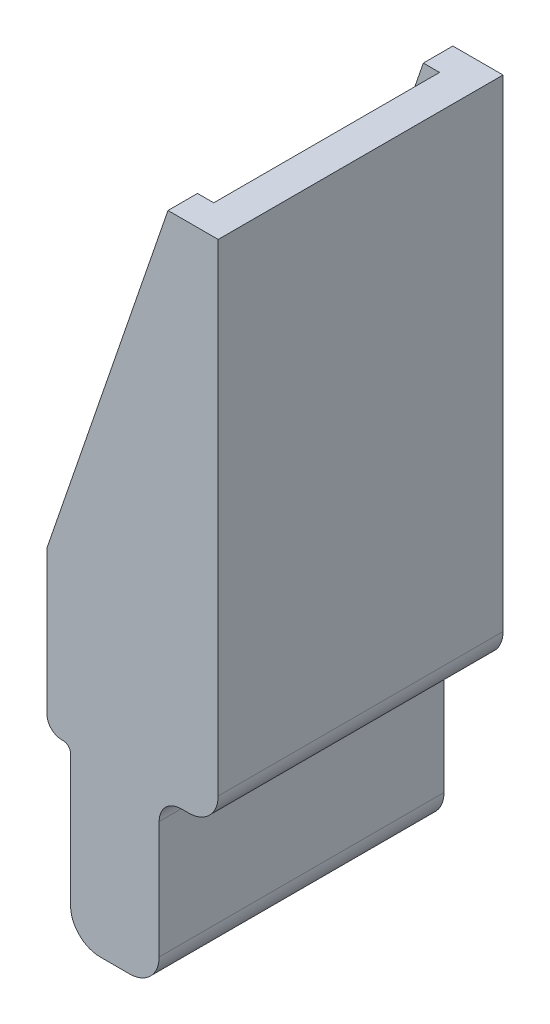
ISO-10303-21;
HEADER;
FILE_DESCRIPTION(('STEP AP214'),'2;1');
FILE_NAME('part.step','',(''),(''),'','','');
FILE_SCHEMA(('AUTOMOTIVE_DESIGN { 1 0 10303 214 1 1 1 1 }'));
ENDSEC;
DATA;
#1=APPLICATION_CONTEXT('core data for automotive mechanical design processes');
#2=APPLICATION_PROTOCOL_DEFINITION('international standard','automotive_design',2000,#1);
#3=PRODUCT_CONTEXT('',#1,'mechanical');
#4=PRODUCT('Part','Part','',(#3));
#5=PRODUCT_RELATED_PRODUCT_CATEGORY('part','',(#4));
#6=PRODUCT_DEFINITION_FORMATION('','',#4);
#7=PRODUCT_DEFINITION_CONTEXT('part definition',#1,'design');
#8=PRODUCT_DEFINITION('design','',#6,#7);
#9=PRODUCT_DEFINITION_SHAPE('','',#8);
#10=(LENGTH_UNIT() NAMED_UNIT(*) SI_UNIT(.MILLI.,.METRE.));
#11=(NAMED_UNIT(*) PLANE_ANGLE_UNIT() SI_UNIT($,.RADIAN.));
#12=(NAMED_UNIT(*) SI_UNIT($,.STERADIAN.) SOLID_ANGLE_UNIT());
#13=UNCERTAINTY_MEASURE_WITH_UNIT(LENGTH_MEASURE(1.E-05),#10,'distance_accuracy_value','');
#14=(GEOMETRIC_REPRESENTATION_CONTEXT(3) GLOBAL_UNCERTAINTY_ASSIGNED_CONTEXT((#13)) GLOBAL_UNIT_ASSIGNED_CONTEXT((#10,
#11,#12)) REPRESENTATION_CONTEXT('',''));
#15=CARTESIAN_POINT('',(0.,0.,0.));
#16=DIRECTION('',(0.,0.,1.));
#17=DIRECTION('',(1.,0.,0.));
#18=AXIS2_PLACEMENT_3D('',#15,#16,#17);
#19=CARTESIAN_POINT('',(2.4,23.05,19.3));
#20=DIRECTION('',(0.945876542694601,-0.324526679920324,0.));
#21=DIRECTION('',(0.324526679920324,0.945876542694601,0.));
#22=AXIS2_PLACEMENT_3D('',#19,#20,#21);
#23=PLANE('',#22);
#24=DIRECTION('',(0.,0.,-1.));
#25=VECTOR('',#24,1.);
#26=CARTESIAN_POINT('',(-5.80000000000001,-0.850000000000011,19.3));
#27=LINE('',#26,#25);
#28=CARTESIAN_POINT('',(-5.8,-0.850000000000011,2.));
#29=VERTEX_POINT('',#28);
#30=CARTESIAN_POINT('',(-5.80000000000001,-0.850000000000011,0.));
#31=VERTEX_POINT('',#30);
#32=EDGE_CURVE('E240',#29,#31,#27,.T.);
#33=ORIENTED_EDGE('',*,*,#32,.F.);
#34=DIRECTION('',(0.324526679920324,0.945876542694601,0.));
#35=VECTOR('',#34,1.);
#36=CARTESIAN_POINT('',(2.4,23.05,2.));
#37=LINE('',#36,#35);
#38=CARTESIAN_POINT('',(2.4,23.05,2.));
#39=VERTEX_POINT('',#38);
#40=EDGE_CURVE('E187',#29,#39,#37,.T.);
#41=ORIENTED_EDGE('',*,*,#40,.T.);
#42=DIRECTION('',(0.,0.,-1.));
#43=VECTOR('',#42,1.);
#44=CARTESIAN_POINT('',(2.4,23.05,19.3));
#45=LINE('',#44,#43);
#46=CARTESIAN_POINT('',(2.4,23.05,0.));
#47=VERTEX_POINT('',#46);
#48=EDGE_CURVE('E244',#39,#47,#45,.T.);
#49=ORIENTED_EDGE('',*,*,#48,.T.);
#50=DIRECTION('',(-0.324526679920324,-0.945876542694601,0.));
#51=VECTOR('',#50,1.);
#52=CARTESIAN_POINT('',(2.4,23.05,0.));
#53=LINE('',#52,#51);
#54=EDGE_CURVE('E192',#47,#31,#53,.T.);
#55=ORIENTED_EDGE('',*,*,#54,.T.);
#56=EDGE_LOOP('',(#33,#41,#49,#55));
#57=FACE_BOUND('',#56,.T.);
#58=ADVANCED_FACE('F32',(#57),#23,.F.);
#59=CARTESIAN_POINT('',(3.79999999999999,-9.60695568829757,19.3));
#60=DIRECTION('',(0.,0.,-1.));
#61=DIRECTION('',(-1.,0.,0.));
#62=AXIS2_PLACEMENT_3D('',#59,#60,#61);
#63=CYLINDRICAL_SURFACE('',#62,2.);
#64=CARTESIAN_POINT('',(3.79999999999999,-9.60695568829757,0.));
#65=DIRECTION('',(0.,0.,1.));
#66=DIRECTION('',(1.,0.,0.));
#67=AXIS2_PLACEMENT_3D('',#64,#65,#66);
#68=CIRCLE('',#67,2.);
#69=CARTESIAN_POINT('',(3.79999999999998,-11.6069556882976,0.));
#70=VERTEX_POINT('',#69);
#71=CARTESIAN_POINT('',(5.79999999999999,-9.60695568829756,0.));
#72=VERTEX_POINT('',#71);
#73=EDGE_CURVE('E183',#70,#72,#68,.T.);
#74=ORIENTED_EDGE('',*,*,#73,.T.);
#75=DIRECTION('',(0.,0.,-1.));
#76=VECTOR('',#75,1.);
#77=CARTESIAN_POINT('',(5.79999999999999,-9.60695568829756,19.3));
#78=LINE('',#77,#76);
#79=CARTESIAN_POINT('',(5.79999999999999,-9.60695568829756,19.3));
#80=VERTEX_POINT('',#79);
#81=EDGE_CURVE('E40',#80,#72,#78,.T.);
#82=ORIENTED_EDGE('',*,*,#81,.F.);
#83=CARTESIAN_POINT('',(3.79999999999999,-9.60695568829757,19.3));
#84=DIRECTION('',(0.,0.,1.));
#85=DIRECTION('',(1.,0.,0.));
#86=AXIS2_PLACEMENT_3D('',#83,#84,#85);
#87=CIRCLE('',#86,2.);
#88=CARTESIAN_POINT('',(3.79999999999998,-11.6069556882976,19.3));
#89=VERTEX_POINT('',#88);
#90=EDGE_CURVE('E215',#89,#80,#87,.T.);
#91=ORIENTED_EDGE('',*,*,#90,.F.);
#92=DIRECTION('',(0.,0.,-1.));
#93=VECTOR('',#92,1.);
#94=CARTESIAN_POINT('',(3.79999999999998,-11.6069556882976,19.3));
#95=LINE('',#94,#93);
#96=EDGE_CURVE('E179',#89,#70,#95,.T.);
#97=ORIENTED_EDGE('',*,*,#96,.T.);
#98=EDGE_LOOP('',(#74,#82,#91,#97));
#99=FACE_BOUND('',#98,.T.);
#100=ADVANCED_FACE('F34',(#99),#63,.T.);
#101=CARTESIAN_POINT('',(5.79999999999999,-9.60695568829756,19.3));
#102=DIRECTION('',(-1.,0.,0.));
#103=DIRECTION('',(0.,0.,1.));
#104=AXIS2_PLACEMENT_3D('',#101,#102,#103);
#105=PLANE('',#104);
#106=DIRECTION('',(0.,1.,0.));
#107=VECTOR('',#106,1.);
#108=CARTESIAN_POINT('',(5.79999999999999,-9.60695568829756,0.));
#109=LINE('',#108,#107);
#110=CARTESIAN_POINT('',(5.79999999999999,23.05,0.));
#111=VERTEX_POINT('',#110);
#112=EDGE_CURVE('E186',#72,#111,#109,.T.);
#113=ORIENTED_EDGE('',*,*,#112,.T.);
#114=DIRECTION('',(0.,0.,-1.));
#115=VECTOR('',#114,1.);
#116=CARTESIAN_POINT('',(5.79999999999999,23.05,19.3));
#117=LINE('',#116,#115);
#118=CARTESIAN_POINT('',(5.79999999999999,23.05,19.3));
#119=VERTEX_POINT('',#118);
#120=EDGE_CURVE('E248',#119,#111,#117,.T.);
#121=ORIENTED_EDGE('',*,*,#120,.F.);
#122=DIRECTION('',(0.,1.,0.));
#123=VECTOR('',#122,1.);
#124=CARTESIAN_POINT('',(5.79999999999999,-9.60695568829756,19.3));
#125=LINE('',#124,#123);
#126=EDGE_CURVE('E119',#80,#119,#125,.T.);
#127=ORIENTED_EDGE('',*,*,#126,.F.);
#128=ORIENTED_EDGE('',*,*,#81,.T.);
#129=EDGE_LOOP('',(#113,#121,#127,#128));
#130=FACE_BOUND('',#129,.T.);
#131=ADVANCED_FACE('F251',(#130),#105,.F.);
#132=CARTESIAN_POINT('',(5.79999999999999,23.05,19.3));
#133=DIRECTION('',(0.,-1.,0.));
#134=DIRECTION('',(1.,0.,0.));
#135=AXIS2_PLACEMENT_3D('',#132,#133,#134);
#136=PLANE('',#135);
#137=ORIENTED_EDGE('',*,*,#48,.F.);
#138=DIRECTION('',(-1.,0.,0.));
#139=VECTOR('',#138,1.);
#140=CARTESIAN_POINT('',(3.5,23.05,2.));
#141=LINE('',#140,#139);
#142=CARTESIAN_POINT('',(3.5,23.05,2.));
#143=VERTEX_POINT('',#142);
#144=EDGE_CURVE('E311',#143,#39,#141,.T.);
#145=ORIENTED_EDGE('',*,*,#144,.F.);
#146=DIRECTION('',(0.,0.,-1.));
#147=VECTOR('',#146,1.);
#148=CARTESIAN_POINT('',(3.5,23.05,17.3));
#149=LINE('',#148,#147);
#150=CARTESIAN_POINT('',(3.5,23.05,17.3));
#151=VERTEX_POINT('',#150);
#152=EDGE_CURVE('E322',#151,#143,#149,.T.);
#153=ORIENTED_EDGE('',*,*,#152,.F.);
#154=DIRECTION('',(-1.,0.,0.));
#155=VECTOR('',#154,1.);
#156=CARTESIAN_POINT('',(3.5,23.05,17.3));
#157=LINE('',#156,#155);
#158=CARTESIAN_POINT('',(2.4,23.05,17.3));
#159=VERTEX_POINT('',#158);
#160=EDGE_CURVE('E308',#151,#159,#157,.T.);
#161=ORIENTED_EDGE('',*,*,#160,.T.);
#162=CARTESIAN_POINT('',(2.4,23.05,19.3));
#163=VERTEX_POINT('',#162);
#164=EDGE_CURVE('E245',#163,#159,#45,.T.);
#165=ORIENTED_EDGE('',*,*,#164,.F.);
#166=DIRECTION('',(-1.,0.,0.));
#167=VECTOR('',#166,1.);
#168=CARTESIAN_POINT('',(5.79999999999999,23.05,19.3));
#169=LINE('',#168,#167);
#170=EDGE_CURVE('E266',#119,#163,#169,.T.);
#171=ORIENTED_EDGE('',*,*,#170,.F.);
#172=ORIENTED_EDGE('',*,*,#120,.T.);
#173=DIRECTION('',(-1.,0.,0.));
#174=VECTOR('',#173,1.);
#175=CARTESIAN_POINT('',(5.79999999999999,23.05,0.));
#176=LINE('',#175,#174);
#177=EDGE_CURVE('E189',#111,#47,#176,.T.);
#178=ORIENTED_EDGE('',*,*,#177,.T.);
#179=EDGE_LOOP('',(#137,#145,#153,#161,#165,#171,#172,#178));
#180=FACE_BOUND('',#179,.T.);
#181=ADVANCED_FACE('F262',(#180),#136,.F.);
#182=ORIENTED_EDGE('',*,*,#164,.T.);
#183=DIRECTION('',(-0.324526679920324,-0.945876542694601,0.));
#184=VECTOR('',#183,1.);
#185=CARTESIAN_POINT('',(2.4,23.05,17.3));
#186=LINE('',#185,#184);
#187=CARTESIAN_POINT('',(-5.8,-0.850000000000011,17.3));
#188=VERTEX_POINT('',#187);
#189=EDGE_CURVE('E302',#159,#188,#186,.T.);
#190=ORIENTED_EDGE('',*,*,#189,.T.);
#191=CARTESIAN_POINT('',(-5.80000000000001,-0.850000000000011,19.3));
#192=VERTEX_POINT('',#191);
#193=EDGE_CURVE('E241',#192,#188,#27,.T.);
#194=ORIENTED_EDGE('',*,*,#193,.F.);
#195=DIRECTION('',(-0.324526679920324,-0.945876542694601,0.));
#196=VECTOR('',#195,1.);
#197=CARTESIAN_POINT('',(2.4,23.05,19.3));
#198=LINE('',#197,#196);
#199=EDGE_CURVE('E269',#163,#192,#198,.T.);
#200=ORIENTED_EDGE('',*,*,#199,.F.);
#201=EDGE_LOOP('',(#182,#190,#194,#200));
#202=FACE_BOUND('',#201,.T.);
#203=ADVANCED_FACE('F369',(#202),#23,.F.);
#204=CARTESIAN_POINT('',(-5.80000000000003,-10.609737320816,19.3));
#205=DIRECTION('',(1.,0.,0.));
#206=DIRECTION('',(0.,1.,0.));
#207=AXIS2_PLACEMENT_3D('',#204,#205,#206);
#208=PLANE('',#207);
#209=DIRECTION('',(0.,0.,1.));
#210=VECTOR('',#209,1.);
#211=CARTESIAN_POINT('',(-5.8,-3.25,2.));
#212=LINE('',#211,#210);
#213=CARTESIAN_POINT('',(-5.8,-3.25,2.));
#214=VERTEX_POINT('',#213);
#215=CARTESIAN_POINT('',(-5.80000000000001,-3.25,17.3));
#216=VERTEX_POINT('',#215);
#217=EDGE_CURVE('E47',#214,#216,#212,.T.);
#218=ORIENTED_EDGE('',*,*,#217,.F.);
#219=DIRECTION('',(0.,1.,0.));
#220=VECTOR('',#219,1.);
#221=CARTESIAN_POINT('',(-5.80000000000003,-10.609737320816,2.));
#222=LINE('',#221,#220);
#223=EDGE_CURVE('E11',#214,#29,#222,.T.);
#224=ORIENTED_EDGE('',*,*,#223,.T.);
#225=ORIENTED_EDGE('',*,*,#32,.T.);
#226=DIRECTION('',(0.,-1.,0.));
#227=VECTOR('',#226,1.);
#228=CARTESIAN_POINT('',(-5.80000000000003,-10.609737320816,0.));
#229=LINE('',#228,#227);
#230=CARTESIAN_POINT('',(-5.80000000000002,-10.609737320816,0.));
#231=VERTEX_POINT('',#230);
#232=EDGE_CURVE('E195',#31,#231,#229,.T.);
#233=ORIENTED_EDGE('',*,*,#232,.T.);
#234=DIRECTION('',(0.,0.,-1.));
#235=VECTOR('',#234,1.);
#236=CARTESIAN_POINT('',(-5.80000000000002,-10.609737320816,19.3));
#237=LINE('',#236,#235);
#238=CARTESIAN_POINT('',(-5.80000000000002,-10.609737320816,19.3));
#239=VERTEX_POINT('',#238);
#240=EDGE_CURVE('E237',#239,#231,#237,.T.);
#241=ORIENTED_EDGE('',*,*,#240,.F.);
#242=DIRECTION('',(0.,-1.,0.));
#243=VECTOR('',#242,1.);
#244=CARTESIAN_POINT('',(-5.80000000000003,-10.609737320816,19.3));
#245=LINE('',#244,#243);
#246=EDGE_CURVE('E271',#192,#239,#245,.T.);
#247=ORIENTED_EDGE('',*,*,#246,.F.);
#248=ORIENTED_EDGE('',*,*,#193,.T.);
#249=DIRECTION('',(0.,1.,0.));
#250=VECTOR('',#249,1.);
#251=CARTESIAN_POINT('',(-5.8,-3.25,17.3));
#252=LINE('',#251,#250);
#253=EDGE_CURVE('E315',#216,#188,#252,.T.);
#254=ORIENTED_EDGE('',*,*,#253,.F.);
#255=EDGE_LOOP('',(#218,#224,#225,#233,#241,#247,#248,#254));
#256=FACE_BOUND('',#255,.T.);
#257=ADVANCED_FACE('F360',(#256),#208,.F.);
#258=CARTESIAN_POINT('',(-4.80000000000001,-10.609737320816,19.3));
#259=DIRECTION('',(0.,0.,-1.));
#260=DIRECTION('',(-1.,0.,0.));
#261=AXIS2_PLACEMENT_3D('',#258,#259,#260);
#262=CYLINDRICAL_SURFACE('',#261,1.00000000000001);
#263=CARTESIAN_POINT('',(-4.80000000000001,-10.609737320816,0.));
#264=DIRECTION('',(0.,0.,1.));
#265=DIRECTION('',(-1.,0.,0.));
#266=AXIS2_PLACEMENT_3D('',#263,#264,#265);
#267=CIRCLE('',#266,1.00000000000001);
#268=CARTESIAN_POINT('',(-4.79534594572987,-11.6097264906468,0.));
#269=VERTEX_POINT('',#268);
#270=EDGE_CURVE('E197',#231,#269,#267,.T.);
#271=ORIENTED_EDGE('',*,*,#270,.T.);
#272=DIRECTION('',(0.,0.,-1.));
#273=VECTOR('',#272,1.);
#274=CARTESIAN_POINT('',(-4.79534594572987,-11.6097264906468,19.3));
#275=LINE('',#274,#273);
#276=CARTESIAN_POINT('',(-4.79534594572987,-11.6097264906468,19.3));
#277=VERTEX_POINT('',#276);
#278=EDGE_CURVE('E234',#277,#269,#275,.T.);
#279=ORIENTED_EDGE('',*,*,#278,.F.);
#280=CARTESIAN_POINT('',(-4.80000000000001,-10.609737320816,19.3));
#281=DIRECTION('',(0.,0.,1.));
#282=DIRECTION('',(-1.,0.,0.));
#283=AXIS2_PLACEMENT_3D('',#280,#281,#282);
#284=CIRCLE('',#283,1.00000000000001);
#285=EDGE_CURVE('E277',#239,#277,#284,.T.);
#286=ORIENTED_EDGE('',*,*,#285,.F.);
#287=ORIENTED_EDGE('',*,*,#240,.T.);
#288=EDGE_LOOP('',(#271,#279,#286,#287));
#289=FACE_BOUND('',#288,.T.);
#290=ADVANCED_FACE('F374',(#289),#262,.T.);
#291=CARTESIAN_POINT('',(-4.70232702713509,-11.6092935708629,19.3));
#292=DIRECTION('',(-0.00465405427015842,0.999989169830779,0.));
#293=DIRECTION('',(-0.999989169830779,-0.00465405427015842,0.));
#294=AXIS2_PLACEMENT_3D('',#291,#292,#293);
#295=PLANE('',#294);
#296=DIRECTION('',(0.999989169830779,0.00465405427015842,0.));
#297=VECTOR('',#296,1.);
#298=CARTESIAN_POINT('',(-4.70232702713509,-11.6092935708629,0.));
#299=LINE('',#298,#297);
#300=CARTESIAN_POINT('',(-4.70232702713509,-11.6092935708629,0.));
#301=VERTEX_POINT('',#300);
#302=EDGE_CURVE('E199',#269,#301,#299,.T.);
#303=ORIENTED_EDGE('',*,*,#302,.T.);
#304=DIRECTION('',(0.,0.,-1.));
#305=VECTOR('',#304,1.);
#306=CARTESIAN_POINT('',(-4.70232702713509,-11.6092935708629,19.3));
#307=LINE('',#306,#305);
#308=CARTESIAN_POINT('',(-4.70232702713509,-11.6092935708629,19.3));
#309=VERTEX_POINT('',#308);
#310=EDGE_CURVE('E231',#309,#301,#307,.T.);
#311=ORIENTED_EDGE('',*,*,#310,.F.);
#312=DIRECTION('',(0.999989169830779,0.00465405427015842,0.));
#313=VECTOR('',#312,1.);
#314=CARTESIAN_POINT('',(-4.70232702713509,-11.6092935708629,19.3));
#315=LINE('',#314,#313);
#316=EDGE_CURVE('E279',#277,#309,#315,.T.);
#317=ORIENTED_EDGE('',*,*,#316,.F.);
#318=ORIENTED_EDGE('',*,*,#278,.T.);
#319=EDGE_LOOP('',(#303,#311,#317,#318));
#320=FACE_BOUND('',#319,.T.);
#321=ADVANCED_FACE('F379',(#320),#295,.F.);
#322=CARTESIAN_POINT('',(-4.70000000000001,-12.1092881557783,19.3));
#323=DIRECTION('',(0.,0.,-1.));
#324=DIRECTION('',(-1.,0.,0.));
#325=AXIS2_PLACEMENT_3D('',#322,#323,#324);
#326=CYLINDRICAL_SURFACE('',#325,0.499999999999999);
#327=CARTESIAN_POINT('',(-4.70000000000001,-12.1092881557783,0.));
#328=DIRECTION('',(0.,0.,-1.));
#329=DIRECTION('',(1.,0.,0.));
#330=AXIS2_PLACEMENT_3D('',#327,#328,#329);
#331=CIRCLE('',#330,0.499999999999999);
#332=CARTESIAN_POINT('',(-4.20000000000001,-12.1092881557783,0.));
#333=VERTEX_POINT('',#332);
#334=EDGE_CURVE('E201',#301,#333,#331,.T.);
#335=ORIENTED_EDGE('',*,*,#334,.T.);
#336=DIRECTION('',(0.,0.,-1.));
#337=VECTOR('',#336,1.);
#338=CARTESIAN_POINT('',(-4.20000000000001,-12.1092881557783,19.3));
#339=LINE('',#338,#337);
#340=CARTESIAN_POINT('',(-4.20000000000001,-12.1092881557783,19.3));
#341=VERTEX_POINT('',#340);
#342=EDGE_CURVE('E228',#341,#333,#339,.T.);
#343=ORIENTED_EDGE('',*,*,#342,.F.);
#344=CARTESIAN_POINT('',(-4.70000000000001,-12.1092881557783,19.3));
#345=DIRECTION('',(0.,0.,-1.));
#346=DIRECTION('',(1.,0.,0.));
#347=AXIS2_PLACEMENT_3D('',#344,#345,#346);
#348=CIRCLE('',#347,0.499999999999999);
#349=EDGE_CURVE('E281',#309,#341,#348,.T.);
#350=ORIENTED_EDGE('',*,*,#349,.F.);
#351=ORIENTED_EDGE('',*,*,#310,.T.);
#352=EDGE_LOOP('',(#335,#343,#350,#351));
#353=FACE_BOUND('',#352,.T.);
#354=ADVANCED_FACE('F385',(#353),#326,.F.);
#355=CARTESIAN_POINT('',(-4.20000000000001,-21.05,19.3));
#356=DIRECTION('',(1.,0.,0.));
#357=DIRECTION('',(0.,0.,-1.));
#358=AXIS2_PLACEMENT_3D('',#355,#356,#357);
#359=PLANE('',#358);
#360=DIRECTION('',(0.,-1.,0.));
#361=VECTOR('',#360,1.);
#362=CARTESIAN_POINT('',(-4.20000000000001,-21.05,0.));
#363=LINE('',#362,#361);
#364=CARTESIAN_POINT('',(-4.20000000000001,-21.05,0.));
#365=VERTEX_POINT('',#364);
#366=EDGE_CURVE('E203',#333,#365,#363,.T.);
#367=ORIENTED_EDGE('',*,*,#366,.T.);
#368=DIRECTION('',(0.,0.,-1.));
#369=VECTOR('',#368,1.);
#370=CARTESIAN_POINT('',(-4.20000000000001,-21.05,19.3));
#371=LINE('',#370,#369);
#372=CARTESIAN_POINT('',(-4.20000000000001,-21.05,19.3));
#373=VERTEX_POINT('',#372);
#374=EDGE_CURVE('E225',#373,#365,#371,.T.);
#375=ORIENTED_EDGE('',*,*,#374,.F.);
#376=DIRECTION('',(0.,-1.,0.));
#377=VECTOR('',#376,1.);
#378=CARTESIAN_POINT('',(-4.20000000000001,-21.05,19.3));
#379=LINE('',#378,#377);
#380=EDGE_CURVE('E283',#341,#373,#379,.T.);
#381=ORIENTED_EDGE('',*,*,#380,.F.);
#382=ORIENTED_EDGE('',*,*,#342,.T.);
#383=EDGE_LOOP('',(#367,#375,#381,#382));
#384=FACE_BOUND('',#383,.T.);
#385=ADVANCED_FACE('F389',(#384),#359,.F.);
#386=CARTESIAN_POINT('',(-2.20000000000001,-21.05,19.3));
#387=DIRECTION('',(0.,0.,-1.));
#388=DIRECTION('',(-1.,0.,0.));
#389=AXIS2_PLACEMENT_3D('',#386,#387,#388);
#390=CYLINDRICAL_SURFACE('',#389,2.);
#391=CARTESIAN_POINT('',(-2.20000000000001,-21.05,0.));
#392=DIRECTION('',(0.,0.,1.));
#393=DIRECTION('',(-1.,0.,0.));
#394=AXIS2_PLACEMENT_3D('',#391,#392,#393);
#395=CIRCLE('',#394,2.);
#396=CARTESIAN_POINT('',(-2.19999999999999,-23.05,0.));
#397=VERTEX_POINT('',#396);
#398=EDGE_CURVE('E205',#365,#397,#395,.T.);
#399=ORIENTED_EDGE('',*,*,#398,.T.);
#400=DIRECTION('',(0.,0.,-1.));
#401=VECTOR('',#400,1.);
#402=CARTESIAN_POINT('',(-2.19999999999999,-23.05,19.3));
#403=LINE('',#402,#401);
#404=CARTESIAN_POINT('',(-2.19999999999999,-23.05,19.3));
#405=VERTEX_POINT('',#404);
#406=EDGE_CURVE('E222',#405,#397,#403,.T.);
#407=ORIENTED_EDGE('',*,*,#406,.F.);
#408=CARTESIAN_POINT('',(-2.20000000000001,-21.05,19.3));
#409=DIRECTION('',(0.,0.,1.));
#410=DIRECTION('',(-1.,0.,0.));
#411=AXIS2_PLACEMENT_3D('',#408,#409,#410);
#412=CIRCLE('',#411,2.);
#413=EDGE_CURVE('E285',#373,#405,#412,.T.);
#414=ORIENTED_EDGE('',*,*,#413,.F.);
#415=ORIENTED_EDGE('',*,*,#374,.T.);
#416=EDGE_LOOP('',(#399,#407,#414,#415));
#417=FACE_BOUND('',#416,.T.);
#418=ADVANCED_FACE('F392',(#417),#390,.T.);
#419=CARTESIAN_POINT('',(-0.200000000000023,-23.05,19.3));
#420=DIRECTION('',(0.,1.,0.));
#421=DIRECTION('',(0.,0.,1.));
#422=AXIS2_PLACEMENT_3D('',#419,#420,#421);
#423=PLANE('',#422);
#424=DIRECTION('',(1.,0.,0.));
#425=VECTOR('',#424,1.);
#426=CARTESIAN_POINT('',(-0.200000000000023,-23.05,0.));
#427=LINE('',#426,#425);
#428=CARTESIAN_POINT('',(-0.200000000000022,-23.05,0.));
#429=VERTEX_POINT('',#428);
#430=EDGE_CURVE('E207',#397,#429,#427,.T.);
#431=ORIENTED_EDGE('',*,*,#430,.T.);
#432=DIRECTION('',(0.,0.,-1.));
#433=VECTOR('',#432,1.);
#434=CARTESIAN_POINT('',(-0.200000000000022,-23.05,19.3));
#435=LINE('',#434,#433);
#436=CARTESIAN_POINT('',(-0.200000000000022,-23.05,19.3));
#437=VERTEX_POINT('',#436);
#438=EDGE_CURVE('E219',#437,#429,#435,.T.);
#439=ORIENTED_EDGE('',*,*,#438,.F.);
#440=DIRECTION('',(1.,0.,0.));
#441=VECTOR('',#440,1.);
#442=CARTESIAN_POINT('',(-0.200000000000023,-23.05,19.3));
#443=LINE('',#442,#441);
#444=EDGE_CURVE('E287',#405,#437,#443,.T.);
#445=ORIENTED_EDGE('',*,*,#444,.F.);
#446=ORIENTED_EDGE('',*,*,#406,.T.);
#447=EDGE_LOOP('',(#431,#439,#445,#446));
#448=FACE_BOUND('',#447,.T.);
#449=ADVANCED_FACE('F293',(#448),#423,.F.);
#450=CARTESIAN_POINT('',(-0.200000000000008,-21.05,19.3));
#451=DIRECTION('',(0.,0.,-1.));
#452=DIRECTION('',(-1.,0.,0.));
#453=AXIS2_PLACEMENT_3D('',#450,#451,#452);
#454=CYLINDRICAL_SURFACE('',#453,2.);
#455=CARTESIAN_POINT('',(-0.200000000000008,-21.05,0.));
#456=DIRECTION('',(0.,0.,1.));
#457=DIRECTION('',(-1.,0.,0.));
#458=AXIS2_PLACEMENT_3D('',#455,#456,#457);
#459=CIRCLE('',#458,2.);
#460=CARTESIAN_POINT('',(1.79999999999999,-21.05,0.));
#461=VERTEX_POINT('',#460);
#462=EDGE_CURVE('E209',#429,#461,#459,.T.);
#463=ORIENTED_EDGE('',*,*,#462,.T.);
#464=DIRECTION('',(0.,0.,-1.));
#465=VECTOR('',#464,1.);
#466=CARTESIAN_POINT('',(1.79999999999999,-21.05,19.3));
#467=LINE('',#466,#465);
#468=CARTESIAN_POINT('',(1.79999999999999,-21.05,19.3));
#469=VERTEX_POINT('',#468);
#470=EDGE_CURVE('E174',#469,#461,#467,.T.);
#471=ORIENTED_EDGE('',*,*,#470,.F.);
#472=CARTESIAN_POINT('',(-0.200000000000008,-21.05,19.3));
#473=DIRECTION('',(0.,0.,1.));
#474=DIRECTION('',(-1.,0.,0.));
#475=AXIS2_PLACEMENT_3D('',#472,#473,#474);
#476=CIRCLE('',#475,2.);
#477=EDGE_CURVE('E162',#437,#469,#476,.T.);
#478=ORIENTED_EDGE('',*,*,#477,.F.);
#479=ORIENTED_EDGE('',*,*,#438,.T.);
#480=EDGE_LOOP('',(#463,#471,#478,#479));
#481=FACE_BOUND('',#480,.T.);
#482=ADVANCED_FACE('F297',(#481),#454,.T.);
#483=CARTESIAN_POINT('',(1.79999999999999,-13.1069556882976,19.3));
#484=DIRECTION('',(-1.,0.,0.));
#485=DIRECTION('',(0.,0.,1.));
#486=AXIS2_PLACEMENT_3D('',#483,#484,#485);
#487=PLANE('',#486);
#488=DIRECTION('',(0.,1.,0.));
#489=VECTOR('',#488,1.);
#490=CARTESIAN_POINT('',(1.79999999999999,-13.1069556882976,0.));
#491=LINE('',#490,#489);
#492=CARTESIAN_POINT('',(1.79999999999999,-13.1069556882976,0.));
#493=VERTEX_POINT('',#492);
#494=EDGE_CURVE('E171',#461,#493,#491,.T.);
#495=ORIENTED_EDGE('',*,*,#494,.T.);
#496=DIRECTION('',(0.,0.,-1.));
#497=VECTOR('',#496,1.);
#498=CARTESIAN_POINT('',(1.79999999999999,-13.1069556882976,19.3));
#499=LINE('',#498,#497);
#500=CARTESIAN_POINT('',(1.79999999999999,-13.1069556882976,19.3));
#501=VERTEX_POINT('',#500);
#502=EDGE_CURVE('E168',#501,#493,#499,.T.);
#503=ORIENTED_EDGE('',*,*,#502,.F.);
#504=DIRECTION('',(0.,1.,0.));
#505=VECTOR('',#504,1.);
#506=CARTESIAN_POINT('',(1.79999999999999,-13.1069556882976,19.3));
#507=LINE('',#506,#505);
#508=EDGE_CURVE('E155',#469,#501,#507,.T.);
#509=ORIENTED_EDGE('',*,*,#508,.F.);
#510=ORIENTED_EDGE('',*,*,#470,.T.);
#511=EDGE_LOOP('',(#495,#503,#509,#510));
#512=FACE_BOUND('',#511,.T.);
#513=ADVANCED_FACE('F169',(#512),#487,.F.);
#514=CARTESIAN_POINT('',(3.29999999999999,-13.1069556882976,19.3));
#515=DIRECTION('',(0.,0.,-1.));
#516=DIRECTION('',(-1.,0.,0.));
#517=AXIS2_PLACEMENT_3D('',#514,#515,#516);
#518=CYLINDRICAL_SURFACE('',#517,1.5);
#519=CARTESIAN_POINT('',(3.29999999999999,-13.1069556882976,0.));
#520=DIRECTION('',(0.,0.,-1.));
#521=DIRECTION('',(-1.,0.,0.));
#522=AXIS2_PLACEMENT_3D('',#519,#520,#521);
#523=CIRCLE('',#522,1.5);
#524=CARTESIAN_POINT('',(3.3,-11.6069556882976,0.));
#525=VERTEX_POINT('',#524);
#526=EDGE_CURVE('E212',#493,#525,#523,.T.);
#527=ORIENTED_EDGE('',*,*,#526,.T.);
#528=DIRECTION('',(0.,0.,-1.));
#529=VECTOR('',#528,1.);
#530=CARTESIAN_POINT('',(3.3,-11.6069556882976,19.3));
#531=LINE('',#530,#529);
#532=CARTESIAN_POINT('',(3.3,-11.6069556882976,19.3));
#533=VERTEX_POINT('',#532);
#534=EDGE_CURVE('E175',#533,#525,#531,.T.);
#535=ORIENTED_EDGE('',*,*,#534,.F.);
#536=CARTESIAN_POINT('',(3.29999999999999,-13.1069556882976,19.3));
#537=DIRECTION('',(0.,0.,-1.));
#538=DIRECTION('',(-1.,0.,0.));
#539=AXIS2_PLACEMENT_3D('',#536,#537,#538);
#540=CIRCLE('',#539,1.5);
#541=EDGE_CURVE('E159',#501,#533,#540,.T.);
#542=ORIENTED_EDGE('',*,*,#541,.F.);
#543=ORIENTED_EDGE('',*,*,#502,.T.);
#544=EDGE_LOOP('',(#527,#535,#542,#543));
#545=FACE_BOUND('',#544,.T.);
#546=ADVANCED_FACE('F177',(#545),#518,.F.);
#547=CARTESIAN_POINT('',(3.3,-11.6069556882976,19.3));
#548=DIRECTION('',(0.,1.,0.));
#549=DIRECTION('',(0.,0.,1.));
#550=AXIS2_PLACEMENT_3D('',#547,#548,#549);
#551=PLANE('',#550);
#552=DIRECTION('',(1.,0.,0.));
#553=VECTOR('',#552,1.);
#554=CARTESIAN_POINT('',(3.3,-11.6069556882976,0.));
#555=LINE('',#554,#553);
#556=EDGE_CURVE('E110',#525,#70,#555,.T.);
#557=ORIENTED_EDGE('',*,*,#556,.T.);
#558=ORIENTED_EDGE('',*,*,#96,.F.);
#559=DIRECTION('',(1.,0.,0.));
#560=VECTOR('',#559,1.);
#561=CARTESIAN_POINT('',(3.3,-11.6069556882976,19.3));
#562=LINE('',#561,#560);
#563=EDGE_CURVE('E56',#533,#89,#562,.T.);
#564=ORIENTED_EDGE('',*,*,#563,.F.);
#565=ORIENTED_EDGE('',*,*,#534,.T.);
#566=EDGE_LOOP('',(#557,#558,#564,#565));
#567=FACE_BOUND('',#566,.T.);
#568=ADVANCED_FACE('F298',(#567),#551,.F.);
#569=CARTESIAN_POINT('',(3.79999999999999,-9.60695568829757,19.3));
#570=DIRECTION('',(0.,0.,1.));
#571=DIRECTION('',(1.,0.,0.));
#572=AXIS2_PLACEMENT_3D('',#569,#570,#571);
#573=PLANE('',#572);
#574=ORIENTED_EDGE('',*,*,#90,.T.);
#575=ORIENTED_EDGE('',*,*,#126,.T.);
#576=ORIENTED_EDGE('',*,*,#170,.T.);
#577=ORIENTED_EDGE('',*,*,#199,.T.);
#578=ORIENTED_EDGE('',*,*,#246,.T.);
#579=ORIENTED_EDGE('',*,*,#285,.T.);
#580=ORIENTED_EDGE('',*,*,#316,.T.);
#581=ORIENTED_EDGE('',*,*,#349,.T.);
#582=ORIENTED_EDGE('',*,*,#380,.T.);
#583=ORIENTED_EDGE('',*,*,#413,.T.);
#584=ORIENTED_EDGE('',*,*,#444,.T.);
#585=ORIENTED_EDGE('',*,*,#477,.T.);
#586=ORIENTED_EDGE('',*,*,#508,.T.);
#587=ORIENTED_EDGE('',*,*,#541,.T.);
#588=ORIENTED_EDGE('',*,*,#563,.T.);
#589=EDGE_LOOP('',(#574,#575,#576,#577,#578,#579,#580,#581,#582,#583,#584,#585,#586,#587,#588));
#590=FACE_BOUND('',#589,.T.);
#591=ADVANCED_FACE('F157',(#590),#573,.T.);
#592=CARTESIAN_POINT('',(3.79999999999999,-9.60695568829757,0.));
#593=DIRECTION('',(0.,0.,1.));
#594=DIRECTION('',(1.,0.,0.));
#595=AXIS2_PLACEMENT_3D('',#592,#593,#594);
#596=PLANE('',#595);
#597=ORIENTED_EDGE('',*,*,#73,.F.);
#598=ORIENTED_EDGE('',*,*,#556,.F.);
#599=ORIENTED_EDGE('',*,*,#526,.F.);
#600=ORIENTED_EDGE('',*,*,#494,.F.);
#601=ORIENTED_EDGE('',*,*,#462,.F.);
#602=ORIENTED_EDGE('',*,*,#430,.F.);
#603=ORIENTED_EDGE('',*,*,#398,.F.);
#604=ORIENTED_EDGE('',*,*,#366,.F.);
#605=ORIENTED_EDGE('',*,*,#334,.F.);
#606=ORIENTED_EDGE('',*,*,#302,.F.);
#607=ORIENTED_EDGE('',*,*,#270,.F.);
#608=ORIENTED_EDGE('',*,*,#232,.F.);
#609=ORIENTED_EDGE('',*,*,#54,.F.);
#610=ORIENTED_EDGE('',*,*,#177,.F.);
#611=ORIENTED_EDGE('',*,*,#112,.F.);
#612=EDGE_LOOP('',(#597,#598,#599,#600,#601,#602,#603,#604,#605,#606,#607,#608,#609,#610,#611));
#613=FACE_BOUND('',#612,.T.);
#614=ADVANCED_FACE('F256',(#613),#596,.F.);
#615=CARTESIAN_POINT('',(3.5,23.05,2.));
#616=DIRECTION('',(0.,0.,-1.));
#617=DIRECTION('',(0.,1.,0.));
#618=AXIS2_PLACEMENT_3D('',#615,#616,#617);
#619=PLANE('',#618);
#620=ORIENTED_EDGE('',*,*,#223,.F.);
#621=DIRECTION('',(-1.,0.,0.));
#622=VECTOR('',#621,1.);
#623=CARTESIAN_POINT('',(3.5,-3.25,2.));
#624=LINE('',#623,#622);
#625=CARTESIAN_POINT('',(3.5,-3.25,2.));
#626=VERTEX_POINT('',#625);
#627=EDGE_CURVE('E305',#626,#214,#624,.T.);
#628=ORIENTED_EDGE('',*,*,#627,.F.);
#629=DIRECTION('',(0.,-1.,0.));
#630=VECTOR('',#629,1.);
#631=CARTESIAN_POINT('',(3.5,23.05,2.));
#632=LINE('',#631,#630);
#633=EDGE_CURVE('E309',#143,#626,#632,.T.);
#634=ORIENTED_EDGE('',*,*,#633,.F.);
#635=ORIENTED_EDGE('',*,*,#144,.T.);
#636=ORIENTED_EDGE('',*,*,#40,.F.);
#637=EDGE_LOOP('',(#620,#628,#634,#635,#636));
#638=FACE_BOUND('',#637,.T.);
#639=ADVANCED_FACE('F356',(#638),#619,.F.);
#640=CARTESIAN_POINT('',(3.5,-3.25,17.3));
#641=DIRECTION('',(0.,0.,1.));
#642=DIRECTION('',(0.,-1.,0.));
#643=AXIS2_PLACEMENT_3D('',#640,#641,#642);
#644=PLANE('',#643);
#645=ORIENTED_EDGE('',*,*,#160,.F.);
#646=DIRECTION('',(0.,1.,0.));
#647=VECTOR('',#646,1.);
#648=CARTESIAN_POINT('',(3.5,-3.25,17.3));
#649=LINE('',#648,#647);
#650=CARTESIAN_POINT('',(3.5,-3.25,17.3));
#651=VERTEX_POINT('',#650);
#652=EDGE_CURVE('E325',#651,#151,#649,.T.);
#653=ORIENTED_EDGE('',*,*,#652,.F.);
#654=DIRECTION('',(-1.,0.,0.));
#655=VECTOR('',#654,1.);
#656=CARTESIAN_POINT('',(3.5,-3.25,17.3));
#657=LINE('',#656,#655);
#658=EDGE_CURVE('E306',#651,#216,#657,.T.);
#659=ORIENTED_EDGE('',*,*,#658,.T.);
#660=ORIENTED_EDGE('',*,*,#253,.T.);
#661=ORIENTED_EDGE('',*,*,#189,.F.);
#662=EDGE_LOOP('',(#645,#653,#659,#660,#661));
#663=FACE_BOUND('',#662,.T.);
#664=ADVANCED_FACE('F367',(#663),#644,.F.);
#665=CARTESIAN_POINT('',(3.5,-3.25,2.));
#666=DIRECTION('',(0.,-1.,0.));
#667=DIRECTION('',(0.,0.,-1.));
#668=AXIS2_PLACEMENT_3D('',#665,#666,#667);
#669=PLANE('',#668);
#670=ORIENTED_EDGE('',*,*,#217,.T.);
#671=ORIENTED_EDGE('',*,*,#658,.F.);
#672=DIRECTION('',(0.,0.,1.));
#673=VECTOR('',#672,1.);
#674=CARTESIAN_POINT('',(3.5,-3.25,2.));
#675=LINE('',#674,#673);
#676=EDGE_CURVE('E318',#626,#651,#675,.T.);
#677=ORIENTED_EDGE('',*,*,#676,.F.);
#678=ORIENTED_EDGE('',*,*,#627,.T.);
#679=EDGE_LOOP('',(#670,#671,#677,#678));
#680=FACE_BOUND('',#679,.T.);
#681=ADVANCED_FACE('F340',(#680),#669,.F.);
#682=CARTESIAN_POINT('',(3.5,0.,0.));
#683=DIRECTION('',(-1.,0.,0.));
#684=DIRECTION('',(0.,0.,1.));
#685=AXIS2_PLACEMENT_3D('',#682,#683,#684);
#686=PLANE('',#685);
#687=ORIENTED_EDGE('',*,*,#676,.T.);
#688=ORIENTED_EDGE('',*,*,#652,.T.);
#689=ORIENTED_EDGE('',*,*,#152,.T.);
#690=ORIENTED_EDGE('',*,*,#633,.T.);
#691=EDGE_LOOP('',(#687,#688,#689,#690));
#692=FACE_BOUND('',#691,.T.);
#693=ADVANCED_FACE('F332',(#692),#686,.T.);
#694=CLOSED_SHELL('',(#58,#100,#131,#181,#203,#257,#290,#321,#354,#385,#418,#449,#482,#513,#546,
#568,#591,#614,#639,#664,#681,#693));
#695=MANIFOLD_SOLID_BREP('B2',#694);
#696=ADVANCED_BREP_SHAPE_REPRESENTATION('',(#18,#695),#14);
#697=SHAPE_DEFINITION_REPRESENTATION(#9,#696);
ENDSEC;
END-ISO-10303-21;
